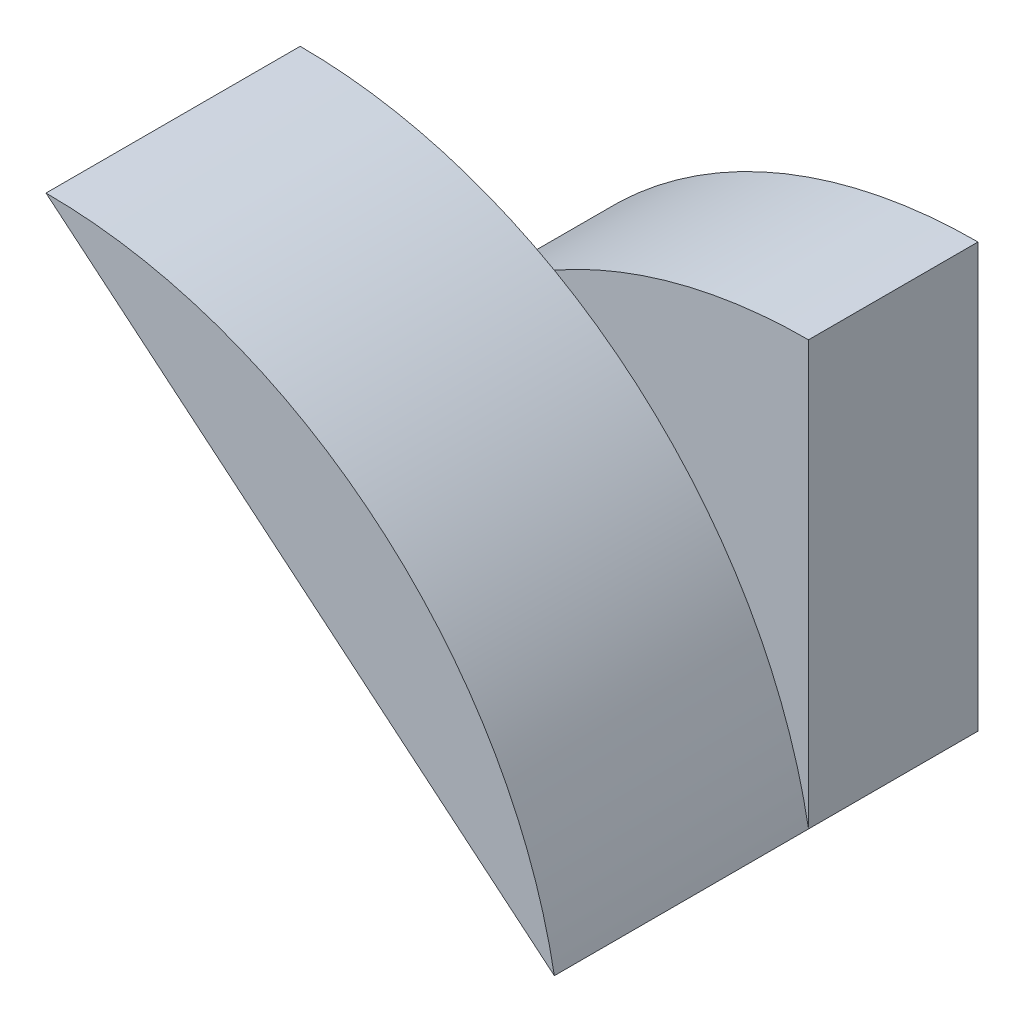
ISO-10303-21;
HEADER;
FILE_DESCRIPTION(('STEP AP214'),'2;1');
FILE_NAME('part.step','',(''),(''),'','','');
FILE_SCHEMA(('AUTOMOTIVE_DESIGN { 1 0 10303 214 1 1 1 1 }'));
ENDSEC;
DATA;
#1=APPLICATION_CONTEXT('core data for automotive mechanical design processes');
#2=APPLICATION_PROTOCOL_DEFINITION('international standard','automotive_design',2000,#1);
#3=PRODUCT_CONTEXT('',#1,'mechanical');
#4=PRODUCT('Part','Part','',(#3));
#5=PRODUCT_RELATED_PRODUCT_CATEGORY('part','',(#4));
#6=PRODUCT_DEFINITION_FORMATION('','',#4);
#7=PRODUCT_DEFINITION_CONTEXT('part definition',#1,'design');
#8=PRODUCT_DEFINITION('design','',#6,#7);
#9=PRODUCT_DEFINITION_SHAPE('','',#8);
#10=(LENGTH_UNIT() NAMED_UNIT(*) SI_UNIT(.MILLI.,.METRE.));
#11=(NAMED_UNIT(*) PLANE_ANGLE_UNIT() SI_UNIT($,.RADIAN.));
#12=(NAMED_UNIT(*) SI_UNIT($,.STERADIAN.) SOLID_ANGLE_UNIT());
#13=UNCERTAINTY_MEASURE_WITH_UNIT(LENGTH_MEASURE(1.E-05),#10,'distance_accuracy_value','');
#14=(GEOMETRIC_REPRESENTATION_CONTEXT(3) GLOBAL_UNCERTAINTY_ASSIGNED_CONTEXT((#13)) GLOBAL_UNIT_ASSIGNED_CONTEXT((#10,
#11,#12)) REPRESENTATION_CONTEXT('',''));
#15=CARTESIAN_POINT('',(0.,0.,0.));
#16=DIRECTION('',(0.,0.,1.));
#17=DIRECTION('',(1.,0.,0.));
#18=AXIS2_PLACEMENT_3D('',#15,#16,#17);
#19=CARTESIAN_POINT('',(0.,-5.5,10.));
#20=DIRECTION('',(0.,0.,-1.));
#21=DIRECTION('',(-1.,0.,0.));
#22=AXIS2_PLACEMENT_3D('',#19,#20,#21);
#23=PLANE('',#22);
#24=CARTESIAN_POINT('',(-30.,-5.5,10.));
#25=DIRECTION('',(0.,0.,1.));
#26=DIRECTION('',(1.,0.,0.));
#27=AXIS2_PLACEMENT_3D('',#24,#25,#26);
#28=CIRCLE('',#27,30.5);
#29=CARTESIAN_POINT('',(0.,0.,10.));
#30=VERTEX_POINT('',#29);
#31=CARTESIAN_POINT('',(-15.,21.056543449779,10.));
#32=VERTEX_POINT('',#31);
#33=EDGE_CURVE('E141',#30,#32,#28,.T.);
#34=ORIENTED_EDGE('',*,*,#33,.F.);
#35=DIRECTION('',(0.,1.,0.));
#36=VECTOR('',#35,1.);
#37=CARTESIAN_POINT('',(0.,0.,10.));
#38=LINE('',#37,#36);
#39=CARTESIAN_POINT('',(0.,25.,10.));
#40=VERTEX_POINT('',#39);
#41=EDGE_CURVE('E117',#30,#40,#38,.T.);
#42=ORIENTED_EDGE('',*,*,#41,.T.);
#43=CARTESIAN_POINT('',(0.,-5.5,10.));
#44=DIRECTION('',(0.,0.,1.));
#45=DIRECTION('',(-1.,0.,0.));
#46=AXIS2_PLACEMENT_3D('',#43,#44,#45);
#47=CIRCLE('',#46,30.5);
#48=EDGE_CURVE('E112',#40,#32,#47,.T.);
#49=ORIENTED_EDGE('',*,*,#48,.T.);
#50=EDGE_LOOP('',(#34,#42,#49));
#51=FACE_BOUND('',#50,.T.);
#52=ADVANCED_FACE('F33',(#51),#23,.F.);
#53=DIRECTION('',(0.768221279597376,-0.64018439966448,0.));
#54=VECTOR('',#53,1.);
#55=CARTESIAN_POINT('',(-30.,25.,10.));
#56=LINE('',#55,#54);
#57=CARTESIAN_POINT('',(-20.4999116918136,17.083259743178,10.));
#58=VERTEX_POINT('',#57);
#59=EDGE_CURVE('E11',#58,#30,#56,.T.);
#60=ORIENTED_EDGE('',*,*,#59,.F.);
#61=CARTESIAN_POINT('',(-30.,0.,10.));
#62=VERTEX_POINT('',#61);
#63=EDGE_CURVE('E115',#58,#62,#47,.T.);
#64=ORIENTED_EDGE('',*,*,#63,.T.);
#65=DIRECTION('',(1.,0.,0.));
#66=VECTOR('',#65,1.);
#67=CARTESIAN_POINT('',(-30.,0.,10.));
#68=LINE('',#67,#66);
#69=EDGE_CURVE('E114',#62,#30,#68,.T.);
#70=ORIENTED_EDGE('',*,*,#69,.T.);
#71=EDGE_LOOP('',(#60,#64,#70));
#72=FACE_BOUND('',#71,.T.);
#73=ADVANCED_FACE('F145',(#72),#23,.F.);
#74=CARTESIAN_POINT('',(0.,-5.5,10.));
#75=DIRECTION('',(0.,0.,-1.));
#76=DIRECTION('',(-1.,0.,0.));
#77=AXIS2_PLACEMENT_3D('',#74,#75,#76);
#78=CYLINDRICAL_SURFACE('',#77,30.5);
#79=CARTESIAN_POINT('',(0.,-5.5,0.));
#80=DIRECTION('',(0.,0.,1.));
#81=DIRECTION('',(-1.,0.,0.));
#82=AXIS2_PLACEMENT_3D('',#79,#80,#81);
#83=CIRCLE('',#82,30.5);
#84=CARTESIAN_POINT('',(0.,25.,0.));
#85=VERTEX_POINT('',#84);
#86=CARTESIAN_POINT('',(-30.,0.,0.));
#87=VERTEX_POINT('',#86);
#88=EDGE_CURVE('E105',#85,#87,#83,.T.);
#89=ORIENTED_EDGE('',*,*,#88,.T.);
#90=DIRECTION('',(0.,0.,-1.));
#91=VECTOR('',#90,1.);
#92=CARTESIAN_POINT('',(-30.,0.,10.));
#93=LINE('',#92,#91);
#94=EDGE_CURVE('E37',#62,#87,#93,.T.);
#95=ORIENTED_EDGE('',*,*,#94,.F.);
#96=ORIENTED_EDGE('',*,*,#63,.F.);
#97=EDGE_CURVE('E55',#32,#58,#47,.T.);
#98=ORIENTED_EDGE('',*,*,#97,.F.);
#99=ORIENTED_EDGE('',*,*,#48,.F.);
#100=DIRECTION('',(0.,0.,-1.));
#101=VECTOR('',#100,1.);
#102=CARTESIAN_POINT('',(0.,25.,10.));
#103=LINE('',#102,#101);
#104=EDGE_CURVE('E118',#40,#85,#103,.T.);
#105=ORIENTED_EDGE('',*,*,#104,.T.);
#106=EDGE_LOOP('',(#89,#95,#96,#98,#99,#105));
#107=FACE_BOUND('',#106,.T.);
#108=ADVANCED_FACE('F35',(#107),#78,.T.);
#109=CARTESIAN_POINT('',(-30.,0.,10.));
#110=DIRECTION('',(0.,1.,0.));
#111=DIRECTION('',(0.,0.,1.));
#112=AXIS2_PLACEMENT_3D('',#109,#110,#111);
#113=PLANE('',#112);
#114=DIRECTION('',(1.,0.,0.));
#115=VECTOR('',#114,1.);
#116=CARTESIAN_POINT('',(-30.,0.,0.));
#117=LINE('',#116,#115);
#118=CARTESIAN_POINT('',(0.,0.,0.));
#119=VERTEX_POINT('',#118);
#120=EDGE_CURVE('E108',#87,#119,#117,.T.);
#121=ORIENTED_EDGE('',*,*,#120,.T.);
#122=DIRECTION('',(0.,0.,-1.));
#123=VECTOR('',#122,1.);
#124=CARTESIAN_POINT('',(0.,0.,10.));
#125=LINE('',#124,#123);
#126=EDGE_CURVE('E124',#30,#119,#125,.T.);
#127=ORIENTED_EDGE('',*,*,#126,.F.);
#128=ORIENTED_EDGE('',*,*,#69,.F.);
#129=ORIENTED_EDGE('',*,*,#94,.T.);
#130=EDGE_LOOP('',(#121,#127,#128,#129));
#131=FACE_BOUND('',#130,.T.);
#132=ADVANCED_FACE('F133',(#131),#113,.F.);
#133=CARTESIAN_POINT('',(0.,0.,10.));
#134=DIRECTION('',(-1.,0.,0.));
#135=DIRECTION('',(0.,0.,1.));
#136=AXIS2_PLACEMENT_3D('',#133,#134,#135);
#137=PLANE('',#136);
#138=DIRECTION('',(0.,1.,0.));
#139=VECTOR('',#138,1.);
#140=CARTESIAN_POINT('',(0.,0.,0.));
#141=LINE('',#140,#139);
#142=EDGE_CURVE('E121',#119,#85,#141,.T.);
#143=ORIENTED_EDGE('',*,*,#142,.T.);
#144=ORIENTED_EDGE('',*,*,#104,.F.);
#145=ORIENTED_EDGE('',*,*,#41,.F.);
#146=ORIENTED_EDGE('',*,*,#126,.T.);
#147=EDGE_LOOP('',(#143,#144,#145,#146));
#148=FACE_BOUND('',#147,.T.);
#149=ADVANCED_FACE('F138',(#148),#137,.F.);
#150=CARTESIAN_POINT('',(0.,-5.5,0.));
#151=DIRECTION('',(0.,0.,-1.));
#152=DIRECTION('',(-1.,0.,0.));
#153=AXIS2_PLACEMENT_3D('',#150,#151,#152);
#154=PLANE('',#153);
#155=ORIENTED_EDGE('',*,*,#88,.F.);
#156=ORIENTED_EDGE('',*,*,#142,.F.);
#157=ORIENTED_EDGE('',*,*,#120,.F.);
#158=EDGE_LOOP('',(#155,#156,#157));
#159=FACE_BOUND('',#158,.T.);
#160=ADVANCED_FACE('F137',(#159),#154,.T.);
#161=CARTESIAN_POINT('',(-30.,-5.5,10.));
#162=DIRECTION('',(0.,0.,1.));
#163=DIRECTION('',(1.,0.,0.));
#164=AXIS2_PLACEMENT_3D('',#161,#162,#163);
#165=PLANE('',#164);
#166=CARTESIAN_POINT('',(-30.,25.,10.));
#167=VERTEX_POINT('',#166);
#168=EDGE_CURVE('E103',#32,#167,#28,.T.);
#169=ORIENTED_EDGE('',*,*,#168,.F.);
#170=ORIENTED_EDGE('',*,*,#97,.T.);
#171=EDGE_CURVE('E43',#167,#58,#56,.T.);
#172=ORIENTED_EDGE('',*,*,#171,.F.);
#173=EDGE_LOOP('',(#169,#170,#172));
#174=FACE_BOUND('',#173,.T.);
#175=ADVANCED_FACE('F143',(#174),#165,.F.);
#176=CARTESIAN_POINT('',(-30.,-5.5,25.));
#177=DIRECTION('',(0.,0.,-1.));
#178=DIRECTION('',(-1.,0.,0.));
#179=AXIS2_PLACEMENT_3D('',#176,#177,#178);
#180=CYLINDRICAL_SURFACE('',#179,30.5);
#181=ORIENTED_EDGE('',*,*,#33,.T.);
#182=ORIENTED_EDGE('',*,*,#168,.T.);
#183=DIRECTION('',(0.,0.,-1.));
#184=VECTOR('',#183,1.);
#185=CARTESIAN_POINT('',(-30.,25.,25.));
#186=LINE('',#185,#184);
#187=CARTESIAN_POINT('',(-30.,25.,25.));
#188=VERTEX_POINT('',#187);
#189=EDGE_CURVE('E90',#188,#167,#186,.T.);
#190=ORIENTED_EDGE('',*,*,#189,.F.);
#191=CARTESIAN_POINT('',(-30.,-5.5,25.));
#192=DIRECTION('',(0.,0.,1.));
#193=DIRECTION('',(1.,0.,0.));
#194=AXIS2_PLACEMENT_3D('',#191,#192,#193);
#195=CIRCLE('',#194,30.5);
#196=CARTESIAN_POINT('',(0.,0.,25.));
#197=VERTEX_POINT('',#196);
#198=EDGE_CURVE('E95',#197,#188,#195,.T.);
#199=ORIENTED_EDGE('',*,*,#198,.F.);
#200=DIRECTION('',(0.,0.,-1.));
#201=VECTOR('',#200,1.);
#202=CARTESIAN_POINT('',(0.,0.,25.));
#203=LINE('',#202,#201);
#204=EDGE_CURVE('E92',#197,#30,#203,.T.);
#205=ORIENTED_EDGE('',*,*,#204,.T.);
#206=EDGE_LOOP('',(#181,#182,#190,#199,#205));
#207=FACE_BOUND('',#206,.T.);
#208=ADVANCED_FACE('F101',(#207),#180,.T.);
#209=CARTESIAN_POINT('',(-30.,25.,25.));
#210=DIRECTION('',(0.64018439966448,0.768221279597376,0.));
#211=DIRECTION('',(-0.768221279597376,0.64018439966448,0.));
#212=AXIS2_PLACEMENT_3D('',#209,#210,#211);
#213=PLANE('',#212);
#214=ORIENTED_EDGE('',*,*,#171,.T.);
#215=ORIENTED_EDGE('',*,*,#59,.T.);
#216=ORIENTED_EDGE('',*,*,#204,.F.);
#217=DIRECTION('',(0.768221279597376,-0.64018439966448,0.));
#218=VECTOR('',#217,1.);
#219=CARTESIAN_POINT('',(-30.,25.,25.));
#220=LINE('',#219,#218);
#221=EDGE_CURVE('E85',#188,#197,#220,.T.);
#222=ORIENTED_EDGE('',*,*,#221,.F.);
#223=ORIENTED_EDGE('',*,*,#189,.T.);
#224=EDGE_LOOP('',(#214,#215,#216,#222,#223));
#225=FACE_BOUND('',#224,.T.);
#226=ADVANCED_FACE('F88',(#225),#213,.F.);
#227=CARTESIAN_POINT('',(-30.,-5.5,25.));
#228=DIRECTION('',(0.,0.,1.));
#229=DIRECTION('',(1.,0.,0.));
#230=AXIS2_PLACEMENT_3D('',#227,#228,#229);
#231=PLANE('',#230);
#232=ORIENTED_EDGE('',*,*,#198,.T.);
#233=ORIENTED_EDGE('',*,*,#221,.T.);
#234=EDGE_LOOP('',(#232,#233));
#235=FACE_BOUND('',#234,.T.);
#236=ADVANCED_FACE('F97',(#235),#231,.T.);
#237=CLOSED_SHELL('',(#52,#73,#108,#132,#149,#160,#175,#208,#226,#236));
#238=MANIFOLD_SOLID_BREP('B2',#237);
#239=ADVANCED_BREP_SHAPE_REPRESENTATION('',(#18,#238),#14);
#240=SHAPE_DEFINITION_REPRESENTATION(#9,#239);
ENDSEC;
END-ISO-10303-21;
